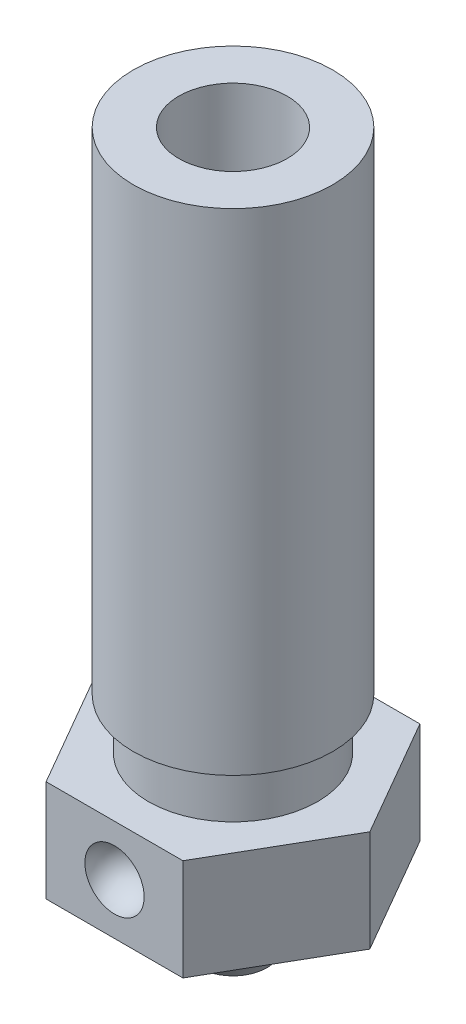
ISO-10303-21;
HEADER;
FILE_DESCRIPTION(('STEP AP214'),'2;1');
FILE_NAME('part.step','',(''),(''),'','','');
FILE_SCHEMA(('AUTOMOTIVE_DESIGN { 1 0 10303 214 1 1 1 1 }'));
ENDSEC;
DATA;
#1=APPLICATION_CONTEXT('core data for automotive mechanical design processes');
#2=APPLICATION_PROTOCOL_DEFINITION('international standard','automotive_design',2000,#1);
#3=PRODUCT_CONTEXT('',#1,'mechanical');
#4=PRODUCT('Part','Part','',(#3));
#5=PRODUCT_RELATED_PRODUCT_CATEGORY('part','',(#4));
#6=PRODUCT_DEFINITION_FORMATION('','',#4);
#7=PRODUCT_DEFINITION_CONTEXT('part definition',#1,'design');
#8=PRODUCT_DEFINITION('design','',#6,#7);
#9=PRODUCT_DEFINITION_SHAPE('','',#8);
#10=(LENGTH_UNIT() NAMED_UNIT(*) SI_UNIT(.MILLI.,.METRE.));
#11=(NAMED_UNIT(*) PLANE_ANGLE_UNIT() SI_UNIT($,.RADIAN.));
#12=(NAMED_UNIT(*) SI_UNIT($,.STERADIAN.) SOLID_ANGLE_UNIT());
#13=UNCERTAINTY_MEASURE_WITH_UNIT(LENGTH_MEASURE(1.E-05),#10,'distance_accuracy_value','');
#14=(GEOMETRIC_REPRESENTATION_CONTEXT(3) GLOBAL_UNCERTAINTY_ASSIGNED_CONTEXT((#13)) GLOBAL_UNIT_ASSIGNED_CONTEXT((#10,
#11,#12)) REPRESENTATION_CONTEXT('',''));
#15=CARTESIAN_POINT('',(0.,0.,0.));
#16=DIRECTION('',(0.,0.,1.));
#17=DIRECTION('',(1.,0.,0.));
#18=AXIS2_PLACEMENT_3D('',#15,#16,#17);
#19=CARTESIAN_POINT('',(15.500000230968,-2.9999999999859,7.00000010430813));
#20=DIRECTION('',(0.,1.,0.));
#21=DIRECTION('',(0.,0.,1.));
#22=AXIS2_PLACEMENT_3D('',#19,#20,#21);
#23=CONICAL_SURFACE('',#22,2.50000000001592,0.64350110880238);
#24=CARTESIAN_POINT('',(15.500000230968,-2.9999999999859,7.00000010430813));
#25=DIRECTION('',(0.,1.,0.));
#26=DIRECTION('',(0.,0.,1.));
#27=AXIS2_PLACEMENT_3D('',#24,#25,#26);
#28=CIRCLE('',#27,2.50000000001592);
#29=CARTESIAN_POINT('',(15.500000230968,-2.9999999999859,9.50000010432405));
#30=VERTEX_POINT('',#29);
#31=EDGE_CURVE('E316',#30,#30,#28,.T.);
#32=ORIENTED_EDGE('',*,*,#31,.F.);
#33=EDGE_LOOP('',(#32));
#34=FACE_BOUND('',#33,.T.);
#35=CARTESIAN_POINT('',(15.500000230968,-5.0000000000523,7.00000010430813));
#36=DIRECTION('',(0.,1.,0.));
#37=DIRECTION('',(0.,0.,1.));
#38=AXIS2_PLACEMENT_3D('',#35,#36,#37);
#39=CIRCLE('',#38,0.999999999937701);
#40=CARTESIAN_POINT('',(15.500000230968,-5.0000000000523,8.00000010424583));
#41=VERTEX_POINT('',#40);
#42=EDGE_CURVE('E20',#41,#41,#39,.F.);
#43=ORIENTED_EDGE('',*,*,#42,.F.);
#44=EDGE_LOOP('',(#43));
#45=FACE_BOUND('',#44,.T.);
#46=ADVANCED_FACE('F17',(#34,#45),#23,.T.);
#47=CARTESIAN_POINT('',(15.500000230968,-5.,7.00000010430813));
#48=DIRECTION('',(0.,-1.,0.));
#49=DIRECTION('',(0.,0.,-1.));
#50=AXIS2_PLACEMENT_3D('',#47,#48,#49);
#51=PLANE('',#50);
#52=CARTESIAN_POINT('',(15.500000230968,-5.,7.00000010430813));
#53=DIRECTION('',(0.,-1.,0.));
#54=DIRECTION('',(0.,0.,-1.));
#55=AXIS2_PLACEMENT_3D('',#52,#53,#54);
#56=CIRCLE('',#55,0.399999999999999);
#57=CARTESIAN_POINT('',(15.500000230968,-5.,6.60000010430813));
#58=VERTEX_POINT('',#57);
#59=EDGE_CURVE('E134',#58,#58,#56,.F.);
#60=ORIENTED_EDGE('',*,*,#59,.T.);
#61=EDGE_LOOP('',(#60));
#62=FACE_BOUND('',#61,.T.);
#63=ORIENTED_EDGE('',*,*,#42,.T.);
#64=EDGE_LOOP('',(#63));
#65=FACE_BOUND('',#64,.T.);
#66=ADVANCED_FACE('F147',(#62,#65),#51,.T.);
#67=CARTESIAN_POINT('',(15.5000009204247,-1.50000002235174,10.5000001043081));
#68=DIRECTION('',(1.,0.,0.));
#69=DIRECTION('',(0.,1.,0.));
#70=AXIS2_PLACEMENT_3D('',#67,#68,#69);
#71=SPHERICAL_SURFACE('',#70,0.875);
#72=CARTESIAN_POINT('',(15.5000009204247,-1.50000002235174,10.5000001043081));
#73=DIRECTION('',(0.,0.,1.));
#74=DIRECTION('',(1.,0.,0.));
#75=AXIS2_PLACEMENT_3D('',#72,#73,#74);
#76=CIRCLE('',#75,0.875);
#77=CARTESIAN_POINT('',(14.6250009204247,-1.50000002235174,10.5000001043081));
#78=VERTEX_POINT('',#77);
#79=CARTESIAN_POINT('',(16.3750009204779,-1.49999909061967,10.5000000468533));
#80=VERTEX_POINT('',#79);
#81=EDGE_CURVE('E119',#78,#80,#76,.F.);
#82=ORIENTED_EDGE('',*,*,#81,.F.);
#83=CARTESIAN_POINT('',(16.3750009204247,-1.50000002235174,10.5000000755807));
#84=CARTESIAN_POINT('',(16.3750009204246,-1.50003335567917,10.5000000606529));
#85=CARTESIAN_POINT('',(16.3750009185199,-1.50006668900698,10.5000000517971));
#86=CARTESIAN_POINT('',(16.3750009070915,-1.50016668899982,10.5000000369658));
#87=CARTESIAN_POINT('',(16.3750008918538,-1.50023335566555,10.500000042726));
#88=CARTESIAN_POINT('',(16.3750007775656,-1.50056668901943,10.5000000633626));
#89=CARTESIAN_POINT('',(16.3750005642177,-1.50083335570491,10.5000000537447));
#90=CARTESIAN_POINT('',(16.3749988881077,-1.50216668964567,10.5000000192879));
#91=CARTESIAN_POINT('',(16.3749955972356,-1.50323335342551,10.5000000353473));
#92=CARTESIAN_POINT('',(16.3749693840122,-1.50856675467485,10.5000000928821));
#93=CARTESIAN_POINT('',(16.3749171850827,-1.51283341816912,10.5000000660645));
#94=CARTESIAN_POINT('',(16.3745002519231,-1.53417017279669,10.4999999700329));
#95=CARTESIAN_POINT('',(16.3736677033502,-1.5512299941715,10.5000000151799));
#96=CARTESIAN_POINT('',(16.3669655778523,-1.63683027928249,10.5000001752617));
#97=CARTESIAN_POINT('',(16.3534773313034,-1.70492209718419,10.5000000879075));
#98=CARTESIAN_POINT('',(16.3017108012257,-1.86401775528295,10.4999999951944));
#99=CARTESIAN_POINT('',(16.25533875651,-1.95247503253615,10.500000040395));
#100=CARTESIAN_POINT('',(16.1359979331062,-2.10898030496436,10.5000000768626));
#101=CARTESIAN_POINT('',(16.0630291544181,-2.17702830013936,10.5000000681297));
#102=CARTESIAN_POINT('',(15.8985286737923,-2.28513113504459,10.5000000773482));
#103=CARTESIAN_POINT('',(15.8069969718546,-2.32518597477483,10.5000000952996));
#104=CARTESIAN_POINT('',(15.6424971720702,-2.36630093472212,10.5000000868577));
#105=CARTESIAN_POINT('',(15.571317117838,-2.37503987291619,10.50000007127));
#106=CARTESIAN_POINT('',(15.4017579519761,-2.37494512545752,10.5000001498203));
#107=CARTESIAN_POINT('',(15.3032566251851,-2.35823075803266,10.5000002876095));
#108=CARTESIAN_POINT('',(15.1174854314802,-2.29311967421037,10.4999999590423));
#109=CARTESIAN_POINT('',(15.0302155645663,-2.24472295781294,10.499999492686));
#110=CARTESIAN_POINT('',(14.8765738544563,-2.12180063252136,10.5000007877132));
#111=CARTESIAN_POINT('',(14.8102020112602,-2.04727502362721,10.5000025490968));
#112=CARTESIAN_POINT('',(14.705886177834,-1.88035656114744,10.4999977569569));
#113=CARTESIAN_POINT('',(14.6679421876039,-1.78796370756182,10.4999912034335));
#114=CARTESIAN_POINT('',(14.6321432695372,-1.6290374268884,10.5000060491541));
#115=CARTESIAN_POINT('',(14.6250082953815,-1.56448702444035,10.5000186423298));
#116=CARTESIAN_POINT('',(14.6250009223239,-1.50006668896339,10.5000001521953));
#117=CARTESIAN_POINT('',(14.6250009204191,-1.50003335563555,10.5000001426196));
#118=CARTESIAN_POINT('',(14.6250009204247,-1.50000002235174,10.5000001330354));
#119=B_SPLINE_CURVE_WITH_KNOTS('',3,(#83,#84,#85,#86,#87,#88,#89,#90,#91,#92,#93,#94,#95,#96,
#97,#98,#99,#100,#101,#102,#103,#104,#105,#106,#107,#108,#109,#110,#111,#112,#113,#114,#115,
#116,#117,#118),.UNSPECIFIED.,.F.,.F.,(4,2,2,2,2,2,2,2,2,2,2,2,2,2,2,2,2,4),(0.,
9.99999875666813E-05,0.00029999998887276,0.00110000007246473,0.00430000542237362,
0.0171003478465966,0.0683222938364999,0.274559472062996,0.568359422544506,0.862159373025964,
1.15595932350742,1.36923357203005,1.66303352251156,1.95683347299302,2.25063342347448,
2.54443337395594,2.7375941343305,2.73769413431807),.UNSPECIFIED.);
#120=EDGE_CURVE('E33',#80,#78,#119,.T.);
#121=ORIENTED_EDGE('',*,*,#120,.F.);
#122=EDGE_LOOP('',(#82,#121));
#123=FACE_BOUND('',#122,.T.);
#124=ADVANCED_FACE('F142',(#123),#71,.F.);
#125=CARTESIAN_POINT('',(15.500000230968,-3.,7.00000010430813));
#126=DIRECTION('',(0.,-1.,0.));
#127=DIRECTION('',(0.,0.,-1.));
#128=AXIS2_PLACEMENT_3D('',#125,#126,#127);
#129=PLANE('',#128);
#130=ORIENTED_EDGE('',*,*,#31,.T.);
#131=EDGE_LOOP('',(#130));
#132=FACE_BOUND('',#131,.T.);
#133=DIRECTION('',(0.500000056865428,0.,0.866025370953166));
#134=VECTOR('',#133,1.);
#135=CARTESIAN_POINT('',(13.4792745186232,-3.,10.5000002369941));
#136=LINE('',#135,#134);
#137=CARTESIAN_POINT('',(11.4585483466406,-3.,7.00000036968013));
#138=VERTEX_POINT('',#137);
#139=CARTESIAN_POINT('',(13.47927448032,-3.,10.5000001706511));
#140=VERTEX_POINT('',#139);
#141=EDGE_CURVE('E122',#138,#140,#136,.T.);
#142=ORIENTED_EDGE('',*,*,#141,.F.);
#143=DIRECTION('',(-0.49999994313457,0.,0.866025436615708));
#144=VECTOR('',#143,1.);
#145=CARTESIAN_POINT('',(11.4585483466406,-3.,7.00000036968013));
#146=LINE('',#145,#144);
#147=CARTESIAN_POINT('',(13.4792740589854,-3.,3.50000023699414));
#148=VERTEX_POINT('',#147);
#149=EDGE_CURVE('E127',#148,#138,#146,.T.);
#150=ORIENTED_EDGE('',*,*,#149,.F.);
#151=DIRECTION('',(-0.999999999999998,0.,6.56625413813762E-08));
#152=VECTOR('',#151,1.);
#153=CARTESIAN_POINT('',(13.4792740589854,-3.,3.50000023699414));
#154=LINE('',#153,#152);
#155=CARTESIAN_POINT('',(17.5207260199191,-3.,3.50000010430814));
#156=VERTEX_POINT('',#155);
#157=EDGE_CURVE('E132',#156,#148,#154,.T.);
#158=ORIENTED_EDGE('',*,*,#157,.F.);
#159=DIRECTION('',(-0.500000056865428,0.,-0.866025370953166));
#160=VECTOR('',#159,1.);
#161=CARTESIAN_POINT('',(17.5207259433128,-3.,3.49999997162213));
#162=LINE('',#161,#160);
#163=CARTESIAN_POINT('',(19.5414521152954,-3.,6.99999983893613));
#164=VERTEX_POINT('',#163);
#165=EDGE_CURVE('E113',#164,#156,#162,.T.);
#166=ORIENTED_EDGE('',*,*,#165,.F.);
#167=DIRECTION('',(0.49999994313457,0.,-0.866025436615708));
#168=VECTOR('',#167,1.);
#169=CARTESIAN_POINT('',(19.5414521152954,-3.,6.99999983893613));
#170=LINE('',#169,#168);
#171=CARTESIAN_POINT('',(17.5207264029506,-3.,10.4999999716221));
#172=VERTEX_POINT('',#171);
#173=EDGE_CURVE('E84',#172,#164,#170,.T.);
#174=ORIENTED_EDGE('',*,*,#173,.F.);
#175=DIRECTION('',(0.999999999999998,0.,-6.56625420681486E-08));
#176=VECTOR('',#175,1.);
#177=CARTESIAN_POINT('',(17.5207264029506,-3.,10.4999999716221));
#178=LINE('',#177,#176);
#179=EDGE_CURVE('E81',#140,#172,#178,.T.);
#180=ORIENTED_EDGE('',*,*,#179,.F.);
#181=EDGE_LOOP('',(#142,#150,#158,#166,#174,#180));
#182=FACE_BOUND('',#181,.T.);
#183=ADVANCED_FACE('F146',(#132,#182),#129,.T.);
#184=CARTESIAN_POINT('',(15.500000230968,-4.2,7.00000010430813));
#185=DIRECTION('',(0.,-1.,0.));
#186=DIRECTION('',(0.,0.,-1.));
#187=AXIS2_PLACEMENT_3D('',#184,#185,#186);
#188=CYLINDRICAL_SURFACE('',#187,0.399999999999999);
#189=ORIENTED_EDGE('',*,*,#59,.F.);
#190=EDGE_LOOP('',(#189));
#191=FACE_BOUND('',#190,.T.);
#192=CARTESIAN_POINT('',(15.500000230968,-3.39999999999918,7.00000010430813));
#193=DIRECTION('',(0.,1.,0.));
#194=DIRECTION('',(0.999999999999998,0.,-6.56625405132138E-08));
#195=AXIS2_PLACEMENT_3D('',#192,#193,#194);
#196=CIRCLE('',#195,0.399999999974625);
#197=CARTESIAN_POINT('',(15.9000002309426,-3.39999999999918,7.00000007804311));
#198=VERTEX_POINT('',#197);
#199=EDGE_CURVE('E109',#198,#198,#196,.T.);
#200=ORIENTED_EDGE('',*,*,#199,.T.);
#201=EDGE_LOOP('',(#200));
#202=FACE_BOUND('',#201,.T.);
#203=ADVANCED_FACE('F176',(#191,#202),#188,.F.);
#204=CARTESIAN_POINT('',(13.4792740589854,0.,3.50000023699414));
#205=DIRECTION('',(-6.56625413813762E-08,0.,-0.999999999999998));
#206=DIRECTION('',(-0.999999999999998,0.,6.56625413813762E-08));
#207=AXIS2_PLACEMENT_3D('',#204,#205,#206);
#208=PLANE('',#207);
#209=ORIENTED_EDGE('',*,*,#157,.T.);
#210=DIRECTION('',(0.,1.,0.));
#211=VECTOR('',#210,1.);
#212=CARTESIAN_POINT('',(13.4792740589854,0.,3.50000023699413));
#213=LINE('',#212,#211);
#214=CARTESIAN_POINT('',(13.4792740972885,0.,3.50000017065114));
#215=VERTEX_POINT('',#214);
#216=EDGE_CURVE('E129',#215,#148,#213,.F.);
#217=ORIENTED_EDGE('',*,*,#216,.F.);
#218=DIRECTION('',(1.,0.,0.));
#219=VECTOR('',#218,1.);
#220=CARTESIAN_POINT('',(15.500000230968,0.,3.49999997162213));
#221=LINE('',#220,#219);
#222=CARTESIAN_POINT('',(17.5207259433128,0.,3.49999997162213));
#223=VERTEX_POINT('',#222);
#224=EDGE_CURVE('E106',#223,#215,#221,.F.);
#225=ORIENTED_EDGE('',*,*,#224,.F.);
#226=DIRECTION('',(0.,1.,0.));
#227=VECTOR('',#226,1.);
#228=CARTESIAN_POINT('',(17.5207259433128,0.,3.49999997162213));
#229=LINE('',#228,#227);
#230=EDGE_CURVE('E110',#156,#223,#229,.T.);
#231=ORIENTED_EDGE('',*,*,#230,.F.);
#232=EDGE_LOOP('',(#209,#217,#225,#231));
#233=FACE_BOUND('',#232,.T.);
#234=ADVANCED_FACE('F173',(#233),#208,.T.);
#235=CARTESIAN_POINT('',(11.4585483466406,0.,7.00000036968013));
#236=DIRECTION('',(-0.866025436615708,0.,-0.49999994313457));
#237=DIRECTION('',(-0.49999994313457,0.,0.866025436615708));
#238=AXIS2_PLACEMENT_3D('',#235,#236,#237);
#239=PLANE('',#238);
#240=ORIENTED_EDGE('',*,*,#149,.T.);
#241=DIRECTION('',(0.,1.,0.));
#242=VECTOR('',#241,1.);
#243=CARTESIAN_POINT('',(11.4585483466406,0.,7.00000036968012));
#244=LINE('',#243,#242);
#245=CARTESIAN_POINT('',(11.4585483466406,0.,7.00000036968013));
#246=VERTEX_POINT('',#245);
#247=EDGE_CURVE('E124',#246,#138,#244,.F.);
#248=ORIENTED_EDGE('',*,*,#247,.F.);
#249=DIRECTION('',(-0.499999943134572,0.,0.866025436615706));
#250=VECTOR('',#249,1.);
#251=CARTESIAN_POINT('',(13.4792740589854,0.,3.50000023699414));
#252=LINE('',#251,#250);
#253=EDGE_CURVE('E101',#215,#246,#252,.T.);
#254=ORIENTED_EDGE('',*,*,#253,.F.);
#255=ORIENTED_EDGE('',*,*,#216,.T.);
#256=EDGE_LOOP('',(#240,#248,#254,#255));
#257=FACE_BOUND('',#256,.T.);
#258=ADVANCED_FACE('F169',(#257),#239,.T.);
#259=CARTESIAN_POINT('',(13.4792745186232,0.,10.5000002369941));
#260=DIRECTION('',(-0.866025370953166,0.,0.500000056865428));
#261=DIRECTION('',(0.500000056865428,0.,0.866025370953166));
#262=AXIS2_PLACEMENT_3D('',#259,#260,#261);
#263=PLANE('',#262);
#264=ORIENTED_EDGE('',*,*,#141,.T.);
#265=DIRECTION('',(0.,1.,0.));
#266=VECTOR('',#265,1.);
#267=CARTESIAN_POINT('',(13.4792745186232,0.,10.5000002369941));
#268=LINE('',#267,#266);
#269=CARTESIAN_POINT('',(13.4792745186232,0.,10.5000002369941));
#270=VERTEX_POINT('',#269);
#271=EDGE_CURVE('E120',#270,#140,#268,.F.);
#272=ORIENTED_EDGE('',*,*,#271,.F.);
#273=DIRECTION('',(0.500000056865434,0.,0.866025370953163));
#274=VECTOR('',#273,1.);
#275=CARTESIAN_POINT('',(11.4585483466406,0.,7.00000036968013));
#276=LINE('',#275,#274);
#277=EDGE_CURVE('E99',#246,#270,#276,.T.);
#278=ORIENTED_EDGE('',*,*,#277,.F.);
#279=ORIENTED_EDGE('',*,*,#247,.T.);
#280=EDGE_LOOP('',(#264,#272,#278,#279));
#281=FACE_BOUND('',#280,.T.);
#282=ADVANCED_FACE('F164',(#281),#263,.T.);
#283=CARTESIAN_POINT('',(17.5207264029506,0.,10.4999999716221));
#284=DIRECTION('',(6.56625420681486E-08,0.,0.999999999999998));
#285=DIRECTION('',(0.999999999999998,0.,-6.56625420681486E-08));
#286=AXIS2_PLACEMENT_3D('',#283,#284,#285);
#287=PLANE('',#286);
#288=ORIENTED_EDGE('',*,*,#120,.T.);
#289=ORIENTED_EDGE('',*,*,#81,.T.);
#290=EDGE_LOOP('',(#288,#289));
#291=FACE_BOUND('',#290,.T.);
#292=ORIENTED_EDGE('',*,*,#179,.T.);
#293=DIRECTION('',(0.,1.,0.));
#294=VECTOR('',#293,1.);
#295=CARTESIAN_POINT('',(17.5207264029506,0.,10.4999999716221));
#296=LINE('',#295,#294);
#297=CARTESIAN_POINT('',(17.5207263646475,0.,10.5000000379651));
#298=VERTEX_POINT('',#297);
#299=EDGE_CURVE('E73',#298,#172,#296,.F.);
#300=ORIENTED_EDGE('',*,*,#299,.F.);
#301=DIRECTION('',(1.,0.,0.));
#302=VECTOR('',#301,1.);
#303=CARTESIAN_POINT('',(15.500000230968,0.,10.5000002369941));
#304=LINE('',#303,#302);
#305=EDGE_CURVE('E78',#270,#298,#304,.T.);
#306=ORIENTED_EDGE('',*,*,#305,.F.);
#307=ORIENTED_EDGE('',*,*,#271,.T.);
#308=EDGE_LOOP('',(#292,#300,#306,#307));
#309=FACE_BOUND('',#308,.T.);
#310=ADVANCED_FACE('F75',(#291,#309),#287,.T.);
#311=CARTESIAN_POINT('',(19.5414521152954,0.,6.99999983893613));
#312=DIRECTION('',(0.866025436615708,0.,0.49999994313457));
#313=DIRECTION('',(0.49999994313457,0.,-0.866025436615708));
#314=AXIS2_PLACEMENT_3D('',#311,#312,#313);
#315=PLANE('',#314);
#316=ORIENTED_EDGE('',*,*,#173,.T.);
#317=DIRECTION('',(0.,1.,0.));
#318=VECTOR('',#317,1.);
#319=CARTESIAN_POINT('',(19.5414521152954,0.,6.99999983893613));
#320=LINE('',#319,#318);
#321=CARTESIAN_POINT('',(19.5414521152954,0.,6.99999983893613));
#322=VERTEX_POINT('',#321);
#323=EDGE_CURVE('E90',#322,#164,#320,.F.);
#324=ORIENTED_EDGE('',*,*,#323,.F.);
#325=DIRECTION('',(0.499999943134574,0.,-0.866025436615705));
#326=VECTOR('',#325,1.);
#327=CARTESIAN_POINT('',(17.5207264029506,0.,10.4999999716221));
#328=LINE('',#327,#326);
#329=EDGE_CURVE('E87',#298,#322,#328,.T.);
#330=ORIENTED_EDGE('',*,*,#329,.F.);
#331=ORIENTED_EDGE('',*,*,#299,.T.);
#332=EDGE_LOOP('',(#316,#324,#330,#331));
#333=FACE_BOUND('',#332,.T.);
#334=ADVANCED_FACE('F88',(#333),#315,.T.);
#335=CARTESIAN_POINT('',(17.5207259433128,0.,3.49999997162213));
#336=DIRECTION('',(0.866025370953166,0.,-0.500000056865428));
#337=DIRECTION('',(-0.500000056865428,0.,-0.866025370953166));
#338=AXIS2_PLACEMENT_3D('',#335,#336,#337);
#339=PLANE('',#338);
#340=ORIENTED_EDGE('',*,*,#165,.T.);
#341=ORIENTED_EDGE('',*,*,#230,.T.);
#342=DIRECTION('',(-0.50000005686543,0.,-0.866025370953165));
#343=VECTOR('',#342,1.);
#344=CARTESIAN_POINT('',(19.5414521152954,0.,6.99999983893613));
#345=LINE('',#344,#343);
#346=EDGE_CURVE('E94',#322,#223,#345,.T.);
#347=ORIENTED_EDGE('',*,*,#346,.F.);
#348=ORIENTED_EDGE('',*,*,#323,.T.);
#349=EDGE_LOOP('',(#340,#341,#347,#348));
#350=FACE_BOUND('',#349,.T.);
#351=ADVANCED_FACE('F216',(#350),#339,.T.);
#352=CARTESIAN_POINT('',(15.500000230968,-1.32153903086873,7.00000010430813));
#353=DIRECTION('',(0.,1.,0.));
#354=DIRECTION('',(0.,0.,1.));
#355=AXIS2_PLACEMENT_3D('',#352,#353,#354);
#356=CONICAL_SURFACE('',#355,1.60000000001446,0.52359877560589);
#357=ORIENTED_EDGE('',*,*,#199,.F.);
#358=EDGE_LOOP('',(#357));
#359=FACE_BOUND('',#358,.T.);
#360=CARTESIAN_POINT('',(15.500000230968,-1.32153903091735,7.00000010430813));
#361=DIRECTION('',(0.,-1.,0.));
#362=DIRECTION('',(0.,0.,-1.));
#363=AXIS2_PLACEMENT_3D('',#360,#361,#362);
#364=CIRCLE('',#363,1.6);
#365=CARTESIAN_POINT('',(15.500000230968,-1.32153903091735,5.40000010430813));
#366=VERTEX_POINT('',#365);
#367=EDGE_CURVE('E229',#366,#366,#364,.F.);
#368=ORIENTED_EDGE('',*,*,#367,.T.);
#369=EDGE_LOOP('',(#368));
#370=FACE_BOUND('',#369,.T.);
#371=ADVANCED_FACE('F213',(#359,#370),#356,.F.);
#372=CARTESIAN_POINT('',(15.500000230968,0.,7.00000010430813));
#373=DIRECTION('',(0.,1.,0.));
#374=DIRECTION('',(0.,0.,1.));
#375=AXIS2_PLACEMENT_3D('',#372,#373,#374);
#376=PLANE('',#375);
#377=CARTESIAN_POINT('',(15.500000230968,0.,7.00000010430813));
#378=DIRECTION('',(0.,1.,0.));
#379=DIRECTION('',(0.,0.,1.));
#380=AXIS2_PLACEMENT_3D('',#377,#378,#379);
#381=CIRCLE('',#380,2.5);
#382=CARTESIAN_POINT('',(15.500000230968,0.,9.50000010430813));
#383=VERTEX_POINT('',#382);
#384=EDGE_CURVE('E157',#383,#383,#381,.T.);
#385=ORIENTED_EDGE('',*,*,#384,.F.);
#386=EDGE_LOOP('',(#385));
#387=FACE_BOUND('',#386,.T.);
#388=ORIENTED_EDGE('',*,*,#329,.T.);
#389=ORIENTED_EDGE('',*,*,#346,.T.);
#390=ORIENTED_EDGE('',*,*,#224,.T.);
#391=ORIENTED_EDGE('',*,*,#253,.T.);
#392=ORIENTED_EDGE('',*,*,#277,.T.);
#393=ORIENTED_EDGE('',*,*,#305,.T.);
#394=EDGE_LOOP('',(#388,#389,#390,#391,#392,#393));
#395=FACE_BOUND('',#394,.T.);
#396=ADVANCED_FACE('F96',(#387,#395),#376,.T.);
#397=CARTESIAN_POINT('',(15.500000230968,8.08923062610236,7.00000010430813));
#398=DIRECTION('',(0.,-1.,0.));
#399=DIRECTION('',(0.,0.,-1.));
#400=AXIS2_PLACEMENT_3D('',#397,#398,#399);
#401=CYLINDRICAL_SURFACE('',#400,1.6);
#402=ORIENTED_EDGE('',*,*,#367,.F.);
#403=EDGE_LOOP('',(#402));
#404=FACE_BOUND('',#403,.T.);
#405=CARTESIAN_POINT('',(15.500000230968,16.,7.00000010430813));
#406=DIRECTION('',(0.,-1.,0.));
#407=DIRECTION('',(0.,0.,-1.));
#408=AXIS2_PLACEMENT_3D('',#405,#406,#407);
#409=CIRCLE('',#408,1.6);
#410=CARTESIAN_POINT('',(15.500000230968,16.,5.40000010430813));
#411=VERTEX_POINT('',#410);
#412=EDGE_CURVE('E237',#411,#411,#409,.T.);
#413=ORIENTED_EDGE('',*,*,#412,.F.);
#414=EDGE_LOOP('',(#413));
#415=FACE_BOUND('',#414,.T.);
#416=ADVANCED_FACE('F206',(#404,#415),#401,.F.);
#417=CARTESIAN_POINT('',(15.500000230968,0.,7.00000010430813));
#418=DIRECTION('',(0.,1.,0.));
#419=DIRECTION('',(0.,0.,1.));
#420=AXIS2_PLACEMENT_3D('',#417,#418,#419);
#421=CYLINDRICAL_SURFACE('',#420,2.5);
#422=ORIENTED_EDGE('',*,*,#384,.T.);
#423=EDGE_LOOP('',(#422));
#424=FACE_BOUND('',#423,.T.);
#425=CARTESIAN_POINT('',(15.500000230968,1.5,7.00000010430813));
#426=DIRECTION('',(0.,1.,0.));
#427=DIRECTION('',(0.,0.,1.));
#428=AXIS2_PLACEMENT_3D('',#425,#426,#427);
#429=CIRCLE('',#428,2.5);
#430=CARTESIAN_POINT('',(15.500000230968,1.5,9.50000010430813));
#431=VERTEX_POINT('',#430);
#432=EDGE_CURVE('E240',#431,#431,#429,.F.);
#433=ORIENTED_EDGE('',*,*,#432,.T.);
#434=EDGE_LOOP('',(#433));
#435=FACE_BOUND('',#434,.T.);
#436=ADVANCED_FACE('F202',(#424,#435),#421,.T.);
#437=CARTESIAN_POINT('',(15.500000230968,16.,7.00000010430813));
#438=DIRECTION('',(0.,1.,0.));
#439=DIRECTION('',(0.,0.,1.));
#440=AXIS2_PLACEMENT_3D('',#437,#438,#439);
#441=PLANE('',#440);
#442=ORIENTED_EDGE('',*,*,#412,.T.);
#443=EDGE_LOOP('',(#442));
#444=FACE_BOUND('',#443,.T.);
#445=CARTESIAN_POINT('',(15.500000230968,16.,7.00000010430813));
#446=DIRECTION('',(0.,1.,0.));
#447=DIRECTION('',(0.,0.,1.));
#448=AXIS2_PLACEMENT_3D('',#445,#446,#447);
#449=CIRCLE('',#448,2.942);
#450=CARTESIAN_POINT('',(15.500000230968,16.,9.94200010430813));
#451=VERTEX_POINT('',#450);
#452=EDGE_CURVE('E26',#451,#451,#449,.F.);
#453=ORIENTED_EDGE('',*,*,#452,.F.);
#454=EDGE_LOOP('',(#453));
#455=FACE_BOUND('',#454,.T.);
#456=ADVANCED_FACE('F195',(#444,#455),#441,.T.);
#457=CARTESIAN_POINT('',(15.500000230968,1.5,7.00000010430813));
#458=DIRECTION('',(0.,1.,0.));
#459=DIRECTION('',(0.,0.,1.));
#460=AXIS2_PLACEMENT_3D('',#457,#458,#459);
#461=PLANE('',#460);
#462=ORIENTED_EDGE('',*,*,#432,.F.);
#463=EDGE_LOOP('',(#462));
#464=FACE_BOUND('',#463,.T.);
#465=CARTESIAN_POINT('',(15.500000230968,1.5,7.00000010430813));
#466=DIRECTION('',(0.,1.,0.));
#467=DIRECTION('',(0.,0.,1.));
#468=AXIS2_PLACEMENT_3D('',#465,#466,#467);
#469=CIRCLE('',#468,2.942);
#470=CARTESIAN_POINT('',(15.500000230968,1.5,9.94200010430813));
#471=VERTEX_POINT('',#470);
#472=EDGE_CURVE('E11',#471,#471,#469,.T.);
#473=ORIENTED_EDGE('',*,*,#472,.F.);
#474=EDGE_LOOP('',(#473));
#475=FACE_BOUND('',#474,.T.);
#476=ADVANCED_FACE('F189',(#464,#475),#461,.F.);
#477=CARTESIAN_POINT('',(15.500000230968,1.5,7.00000010430813));
#478=DIRECTION('',(0.,1.,0.));
#479=DIRECTION('',(0.,0.,1.));
#480=AXIS2_PLACEMENT_3D('',#477,#478,#479);
#481=CYLINDRICAL_SURFACE('',#480,2.942);
#482=ORIENTED_EDGE('',*,*,#472,.T.);
#483=EDGE_LOOP('',(#482));
#484=FACE_BOUND('',#483,.T.);
#485=ORIENTED_EDGE('',*,*,#452,.T.);
#486=EDGE_LOOP('',(#485));
#487=FACE_BOUND('',#486,.T.);
#488=ADVANCED_FACE('F187',(#484,#487),#481,.T.);
#489=CLOSED_SHELL('',(#46,#66,#124,#183,#203,#234,#258,#282,#310,#334,#351,#371,#396,#416,#436,
#456,#476,#488));
#490=MANIFOLD_SOLID_BREP('B1',#489);
#491=ADVANCED_BREP_SHAPE_REPRESENTATION('',(#18,#490),#14);
#492=SHAPE_DEFINITION_REPRESENTATION(#9,#491);
ENDSEC;
END-ISO-10303-21;
